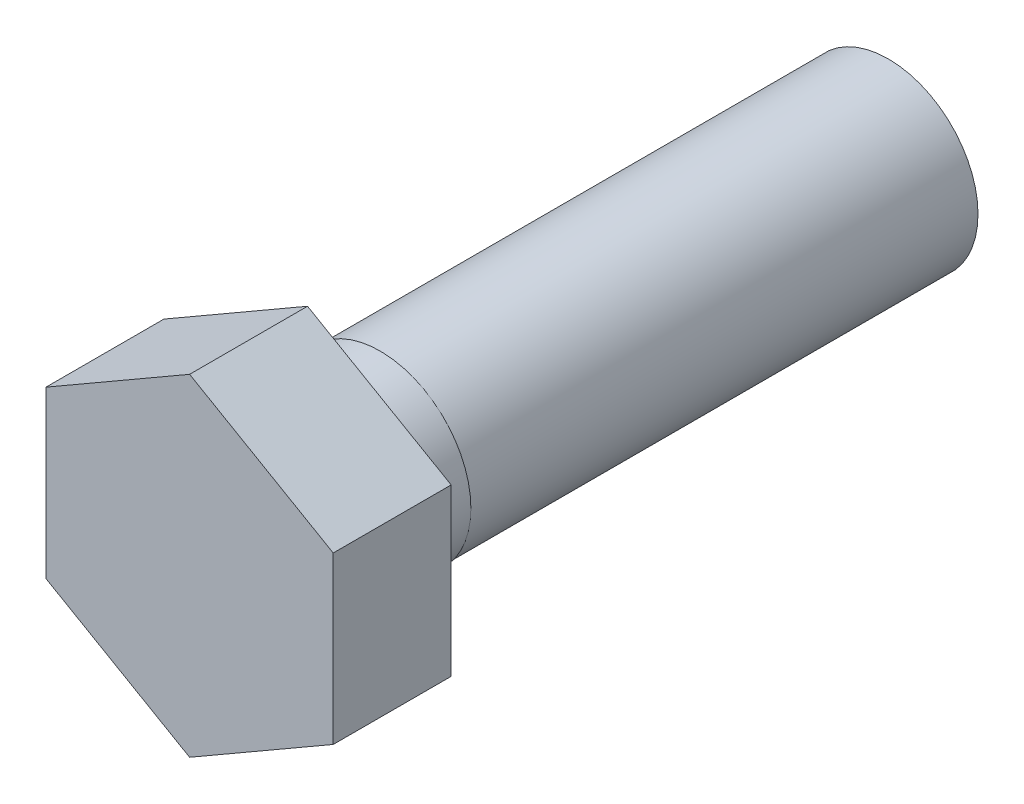
ISO-10303-21;
HEADER;
FILE_DESCRIPTION(('STEP AP214'),'2;1');
FILE_NAME('part.step','',(''),(''),'','','');
FILE_SCHEMA(('AUTOMOTIVE_DESIGN { 1 0 10303 214 1 1 1 1 }'));
ENDSEC;
DATA;
#1=APPLICATION_CONTEXT('core data for automotive mechanical design processes');
#2=APPLICATION_PROTOCOL_DEFINITION('international standard','automotive_design',2000,#1);
#3=PRODUCT_CONTEXT('',#1,'mechanical');
#4=PRODUCT('Part','Part','',(#3));
#5=PRODUCT_RELATED_PRODUCT_CATEGORY('part','',(#4));
#6=PRODUCT_DEFINITION_FORMATION('','',#4);
#7=PRODUCT_DEFINITION_CONTEXT('part definition',#1,'design');
#8=PRODUCT_DEFINITION('design','',#6,#7);
#9=PRODUCT_DEFINITION_SHAPE('','',#8);
#10=(LENGTH_UNIT() NAMED_UNIT(*) SI_UNIT(.MILLI.,.METRE.));
#11=(NAMED_UNIT(*) PLANE_ANGLE_UNIT() SI_UNIT($,.RADIAN.));
#12=(NAMED_UNIT(*) SI_UNIT($,.STERADIAN.) SOLID_ANGLE_UNIT());
#13=UNCERTAINTY_MEASURE_WITH_UNIT(LENGTH_MEASURE(1.E-05),#10,'distance_accuracy_value','');
#14=(GEOMETRIC_REPRESENTATION_CONTEXT(3) GLOBAL_UNCERTAINTY_ASSIGNED_CONTEXT((#13)) GLOBAL_UNIT_ASSIGNED_CONTEXT((#10,
#11,#12)) REPRESENTATION_CONTEXT('',''));
#15=CARTESIAN_POINT('',(0.,0.,0.));
#16=DIRECTION('',(0.,0.,1.));
#17=DIRECTION('',(1.,0.,0.));
#18=AXIS2_PLACEMENT_3D('',#15,#16,#17);
#19=CARTESIAN_POINT('',(4.44089209850063E-13,3.88578058618805E-13,-25.4));
#20=DIRECTION('',(0.,0.,0.999999999999999));
#21=DIRECTION('',(1.,0.,0.));
#22=AXIS2_PLACEMENT_3D('',#19,#20,#21);
#23=CYLINDRICAL_SURFACE('',#22,3.96875);
#24=CARTESIAN_POINT('',(0.,0.,0.));
#25=DIRECTION('',(0.,0.,-0.999999999999999));
#26=DIRECTION('',(-1.,0.,0.));
#27=AXIS2_PLACEMENT_3D('',#24,#25,#26);
#28=CIRCLE('',#27,3.96875);
#29=CARTESIAN_POINT('',(-3.96875,0.,0.));
#30=VERTEX_POINT('',#29);
#31=EDGE_CURVE('E11',#30,#30,#28,.T.);
#32=ORIENTED_EDGE('',*,*,#31,.T.);
#33=EDGE_LOOP('',(#32));
#34=FACE_BOUND('',#33,.T.);
#35=CARTESIAN_POINT('',(0.,-2.77555756156289E-13,-3.17500000000027));
#36=DIRECTION('',(0.,0.,0.999999999999999));
#37=DIRECTION('',(1.,0.,0.));
#38=AXIS2_PLACEMENT_3D('',#35,#36,#37);
#39=CIRCLE('',#38,3.96875);
#40=CARTESIAN_POINT('',(3.96875,-2.78436995682085E-13,-3.17500000000027));
#41=VERTEX_POINT('',#40);
#42=EDGE_CURVE('E105',#41,#41,#39,.T.);
#43=ORIENTED_EDGE('',*,*,#42,.T.);
#44=EDGE_LOOP('',(#43));
#45=FACE_BOUND('',#44,.T.);
#46=ADVANCED_FACE('F32',(#34,#45),#23,.T.);
#47=CARTESIAN_POINT('',(-6.28014999999937,3.62584629305135,5.15619999999993));
#48=DIRECTION('',(-0.500000000000003,0.866025403784437,0.));
#49=DIRECTION('',(-0.866025403784437,-0.500000000000003,0.));
#50=AXIS2_PLACEMENT_3D('',#47,#48,#49);
#51=PLANE('',#50);
#52=DIRECTION('',(0.866025403784437,0.500000000000003,0.));
#53=VECTOR('',#52,1.);
#54=CARTESIAN_POINT('',(-6.28014999999937,3.62584629305068,-2.91433543964104E-13));
#55=LINE('',#54,#53);
#56=CARTESIAN_POINT('',(-6.28014999999937,3.62584629305068,-2.91433543964104E-13));
#57=VERTEX_POINT('',#56);
#58=CARTESIAN_POINT('',(0.,7.25169258610231,0.));
#59=VERTEX_POINT('',#58);
#60=EDGE_CURVE('E86',#57,#59,#55,.T.);
#61=ORIENTED_EDGE('',*,*,#60,.F.);
#62=DIRECTION('',(0.,0.,-0.999999999999999));
#63=VECTOR('',#62,1.);
#64=CARTESIAN_POINT('',(-6.28014999999937,3.62584629305135,5.15619999999993));
#65=LINE('',#64,#63);
#66=CARTESIAN_POINT('',(-6.28014999999937,3.62584629305135,5.15619999999993));
#67=VERTEX_POINT('',#66);
#68=EDGE_CURVE('E40',#67,#57,#65,.T.);
#69=ORIENTED_EDGE('',*,*,#68,.F.);
#70=DIRECTION('',(0.866025403784437,0.500000000000003,0.));
#71=VECTOR('',#70,1.);
#72=CARTESIAN_POINT('',(-6.28014999999937,3.62584629305135,5.15619999999993));
#73=LINE('',#72,#71);
#74=CARTESIAN_POINT('',(0.,7.25169258610231,5.15620000000004));
#75=VERTEX_POINT('',#74);
#76=EDGE_CURVE('E88',#67,#75,#73,.T.);
#77=ORIENTED_EDGE('',*,*,#76,.T.);
#78=DIRECTION('',(0.,0.,-0.999999999999999));
#79=VECTOR('',#78,1.);
#80=CARTESIAN_POINT('',(0.,7.25169258610231,5.15620000000004));
#81=LINE('',#80,#79);
#82=EDGE_CURVE('E83',#75,#59,#81,.T.);
#83=ORIENTED_EDGE('',*,*,#82,.T.);
#84=EDGE_LOOP('',(#61,#69,#77,#83));
#85=FACE_BOUND('',#84,.T.);
#86=ADVANCED_FACE('F34',(#85),#51,.T.);
#87=CARTESIAN_POINT('',(-6.28014999999982,-3.62584629305146,5.1562000000001));
#88=DIRECTION('',(-1.,0.,0.));
#89=DIRECTION('',(0.,-1.,0.));
#90=AXIS2_PLACEMENT_3D('',#87,#88,#89);
#91=PLANE('',#90);
#92=DIRECTION('',(0.,1.,0.));
#93=VECTOR('',#92,1.);
#94=CARTESIAN_POINT('',(-6.28014999999893,-3.62584629305146,-1.52655665885959E-13));
#95=LINE('',#94,#93);
#96=CARTESIAN_POINT('',(-6.28014999999893,-3.62584629305146,-1.52655665885959E-13));
#97=VERTEX_POINT('',#96);
#98=EDGE_CURVE('E104',#97,#57,#95,.T.);
#99=ORIENTED_EDGE('',*,*,#98,.F.);
#100=DIRECTION('',(0.,0.,-0.999999999999999));
#101=VECTOR('',#100,1.);
#102=CARTESIAN_POINT('',(-6.28014999999982,-3.62584629305146,5.1562000000001));
#103=LINE('',#102,#101);
#104=CARTESIAN_POINT('',(-6.28014999999982,-3.62584629305146,5.1562000000001));
#105=VERTEX_POINT('',#104);
#106=EDGE_CURVE('E54',#105,#97,#103,.T.);
#107=ORIENTED_EDGE('',*,*,#106,.F.);
#108=DIRECTION('',(0.,1.,0.));
#109=VECTOR('',#108,1.);
#110=CARTESIAN_POINT('',(-6.28014999999982,-3.62584629305146,5.1562000000001));
#111=LINE('',#110,#109);
#112=EDGE_CURVE('E93',#105,#67,#111,.T.);
#113=ORIENTED_EDGE('',*,*,#112,.T.);
#114=ORIENTED_EDGE('',*,*,#68,.T.);
#115=EDGE_LOOP('',(#99,#107,#113,#114));
#116=FACE_BOUND('',#115,.T.);
#117=ADVANCED_FACE('F146',(#116),#91,.T.);
#118=CARTESIAN_POINT('',(8.88178419700125E-13,-7.25169258610286,5.15619999999987));
#119=DIRECTION('',(-0.499999999999997,-0.866025403784441,0.));
#120=DIRECTION('',(0.86602540378444,-0.499999999999998,0.));
#121=AXIS2_PLACEMENT_3D('',#118,#119,#120);
#122=PLANE('',#121);
#123=DIRECTION('',(-0.86602540378444,0.499999999999998,0.));
#124=VECTOR('',#123,1.);
#125=CARTESIAN_POINT('',(0.,-7.25169258610242,0.));
#126=LINE('',#125,#124);
#127=CARTESIAN_POINT('',(0.,-7.25169258610242,0.));
#128=VERTEX_POINT('',#127);
#129=EDGE_CURVE('E116',#128,#97,#126,.T.);
#130=ORIENTED_EDGE('',*,*,#129,.F.);
#131=DIRECTION('',(0.,0.,-0.999999999999999));
#132=VECTOR('',#131,1.);
#133=CARTESIAN_POINT('',(8.88178419700125E-13,-7.25169258610286,5.15619999999987));
#134=LINE('',#133,#132);
#135=CARTESIAN_POINT('',(8.88178419700125E-13,-7.25169258610286,5.15619999999987));
#136=VERTEX_POINT('',#135);
#137=EDGE_CURVE('E133',#136,#128,#134,.T.);
#138=ORIENTED_EDGE('',*,*,#137,.F.);
#139=DIRECTION('',(-0.86602540378444,0.499999999999998,0.));
#140=VECTOR('',#139,1.);
#141=CARTESIAN_POINT('',(8.88178419700125E-13,-7.25169258610286,5.15619999999987));
#142=LINE('',#141,#140);
#143=EDGE_CURVE('E128',#136,#105,#142,.T.);
#144=ORIENTED_EDGE('',*,*,#143,.T.);
#145=ORIENTED_EDGE('',*,*,#106,.T.);
#146=EDGE_LOOP('',(#130,#138,#144,#145));
#147=FACE_BOUND('',#146,.T.);
#148=ADVANCED_FACE('F151',(#147),#122,.T.);
#149=CARTESIAN_POINT('',(6.28015000000026,-3.62584629305102,5.15619999999982));
#150=DIRECTION('',(0.499999999999999,-0.866025403784439,0.));
#151=DIRECTION('',(0.866025403784438,0.5,0.));
#152=AXIS2_PLACEMENT_3D('',#149,#150,#151);
#153=PLANE('',#152);
#154=DIRECTION('',(-0.866025403784438,-0.5,0.));
#155=VECTOR('',#154,1.);
#156=CARTESIAN_POINT('',(6.28014999999982,-3.62584629305135,0.));
#157=LINE('',#156,#155);
#158=CARTESIAN_POINT('',(6.28014999999982,-3.62584629305135,0.));
#159=VERTEX_POINT('',#158);
#160=EDGE_CURVE('E113',#159,#128,#157,.T.);
#161=ORIENTED_EDGE('',*,*,#160,.F.);
#162=DIRECTION('',(0.,0.,-0.999999999999999));
#163=VECTOR('',#162,1.);
#164=CARTESIAN_POINT('',(6.28015000000026,-3.62584629305102,5.15619999999982));
#165=LINE('',#164,#163);
#166=CARTESIAN_POINT('',(6.28015000000026,-3.62584629305102,5.15619999999982));
#167=VERTEX_POINT('',#166);
#168=EDGE_CURVE('E135',#167,#159,#165,.T.);
#169=ORIENTED_EDGE('',*,*,#168,.F.);
#170=DIRECTION('',(-0.866025403784438,-0.5,0.));
#171=VECTOR('',#170,1.);
#172=CARTESIAN_POINT('',(6.28015000000026,-3.62584629305102,5.15619999999982));
#173=LINE('',#172,#171);
#174=EDGE_CURVE('E125',#167,#136,#173,.T.);
#175=ORIENTED_EDGE('',*,*,#174,.T.);
#176=ORIENTED_EDGE('',*,*,#137,.T.);
#177=EDGE_LOOP('',(#161,#169,#175,#176));
#178=FACE_BOUND('',#177,.T.);
#179=ADVANCED_FACE('F143',(#178),#153,.T.);
#180=CARTESIAN_POINT('',(6.28015000000026,3.62584629305091,5.15619999999979));
#181=DIRECTION('',(1.,0.,0.));
#182=DIRECTION('',(0.,1.,0.));
#183=AXIS2_PLACEMENT_3D('',#180,#181,#182);
#184=PLANE('',#183);
#185=DIRECTION('',(0.,-1.,0.));
#186=VECTOR('',#185,1.);
#187=CARTESIAN_POINT('',(6.28015000000026,3.62584629305135,-3.19189119579733E-13));
#188=LINE('',#187,#186);
#189=CARTESIAN_POINT('',(6.28015000000026,3.62584629305135,-3.19189119579733E-13));
#190=VERTEX_POINT('',#189);
#191=EDGE_CURVE('E100',#190,#159,#188,.T.);
#192=ORIENTED_EDGE('',*,*,#191,.F.);
#193=DIRECTION('',(0.,0.,-0.999999999999999));
#194=VECTOR('',#193,1.);
#195=CARTESIAN_POINT('',(6.28015000000026,3.62584629305091,5.15619999999979));
#196=LINE('',#195,#194);
#197=CARTESIAN_POINT('',(6.28015000000026,3.62584629305091,5.15619999999979));
#198=VERTEX_POINT('',#197);
#199=EDGE_CURVE('E92',#198,#190,#196,.T.);
#200=ORIENTED_EDGE('',*,*,#199,.F.);
#201=DIRECTION('',(0.,-1.,0.));
#202=VECTOR('',#201,1.);
#203=CARTESIAN_POINT('',(6.28015000000026,3.62584629305091,5.15619999999979));
#204=LINE('',#203,#202);
#205=EDGE_CURVE('E122',#198,#167,#204,.T.);
#206=ORIENTED_EDGE('',*,*,#205,.T.);
#207=ORIENTED_EDGE('',*,*,#168,.T.);
#208=EDGE_LOOP('',(#192,#200,#206,#207));
#209=FACE_BOUND('',#208,.T.);
#210=ADVANCED_FACE('F139',(#209),#184,.T.);
#211=CARTESIAN_POINT('',(0.,7.25169258610231,5.15620000000004));
#212=DIRECTION('',(0.500000000000004,0.866025403784436,0.));
#213=DIRECTION('',(-0.866025403784436,0.500000000000005,0.));
#214=AXIS2_PLACEMENT_3D('',#211,#212,#213);
#215=PLANE('',#214);
#216=DIRECTION('',(0.866025403784436,-0.500000000000005,0.));
#217=VECTOR('',#216,1.);
#218=CARTESIAN_POINT('',(0.,7.25169258610231,0.));
#219=LINE('',#218,#217);
#220=EDGE_CURVE('E95',#59,#190,#219,.T.);
#221=ORIENTED_EDGE('',*,*,#220,.F.);
#222=ORIENTED_EDGE('',*,*,#82,.F.);
#223=DIRECTION('',(0.866025403784436,-0.500000000000005,0.));
#224=VECTOR('',#223,1.);
#225=CARTESIAN_POINT('',(0.,7.25169258610231,5.15620000000004));
#226=LINE('',#225,#224);
#227=EDGE_CURVE('E120',#75,#198,#226,.T.);
#228=ORIENTED_EDGE('',*,*,#227,.T.);
#229=ORIENTED_EDGE('',*,*,#199,.T.);
#230=EDGE_LOOP('',(#221,#222,#228,#229));
#231=FACE_BOUND('',#230,.T.);
#232=ADVANCED_FACE('F96',(#231),#215,.T.);
#233=CARTESIAN_POINT('',(0.,7.25169258610231,5.15620000000004));
#234=DIRECTION('',(0.,0.,-0.999999999999999));
#235=DIRECTION('',(-1.,0.,0.));
#236=AXIS2_PLACEMENT_3D('',#233,#234,#235);
#237=PLANE('',#236);
#238=ORIENTED_EDGE('',*,*,#76,.F.);
#239=ORIENTED_EDGE('',*,*,#112,.F.);
#240=ORIENTED_EDGE('',*,*,#143,.F.);
#241=ORIENTED_EDGE('',*,*,#174,.F.);
#242=ORIENTED_EDGE('',*,*,#205,.F.);
#243=ORIENTED_EDGE('',*,*,#227,.F.);
#244=EDGE_LOOP('',(#238,#239,#240,#241,#242,#243));
#245=FACE_BOUND('',#244,.T.);
#246=ADVANCED_FACE('F150',(#245),#237,.F.);
#247=CARTESIAN_POINT('',(0.,7.25169258610231,0.));
#248=DIRECTION('',(0.,0.,-0.999999999999999));
#249=DIRECTION('',(-1.,0.,0.));
#250=AXIS2_PLACEMENT_3D('',#247,#248,#249);
#251=PLANE('',#250);
#252=ORIENTED_EDGE('',*,*,#31,.F.);
#253=EDGE_LOOP('',(#252));
#254=FACE_BOUND('',#253,.T.);
#255=ORIENTED_EDGE('',*,*,#60,.T.);
#256=ORIENTED_EDGE('',*,*,#220,.T.);
#257=ORIENTED_EDGE('',*,*,#191,.T.);
#258=ORIENTED_EDGE('',*,*,#160,.T.);
#259=ORIENTED_EDGE('',*,*,#129,.T.);
#260=ORIENTED_EDGE('',*,*,#98,.T.);
#261=EDGE_LOOP('',(#255,#256,#257,#258,#259,#260));
#262=FACE_BOUND('',#261,.T.);
#263=ADVANCED_FACE('F102',(#254,#262),#251,.T.);
#264=CARTESIAN_POINT('',(0.,3.9687499999998,-3.17500000000003));
#265=DIRECTION('',(0.,0.,-0.999999999999999));
#266=DIRECTION('',(-1.,0.,0.));
#267=AXIS2_PLACEMENT_3D('',#264,#265,#266);
#268=PLANE('',#267);
#269=CARTESIAN_POINT('',(0.,-2.77555756156289E-13,-3.17500000000027));
#270=DIRECTION('',(0.,0.,0.999999999999999));
#271=DIRECTION('',(1.,0.,0.));
#272=AXIS2_PLACEMENT_3D('',#269,#270,#271);
#273=CIRCLE('',#272,3.91875);
#274=CARTESIAN_POINT('',(3.91875,-2.78425893451839E-13,-3.17500000000027));
#275=VERTEX_POINT('',#274);
#276=EDGE_CURVE('E108',#275,#275,#273,.T.);
#277=ORIENTED_EDGE('',*,*,#276,.T.);
#278=EDGE_LOOP('',(#277));
#279=FACE_BOUND('',#278,.T.);
#280=ORIENTED_EDGE('',*,*,#42,.F.);
#281=EDGE_LOOP('',(#280));
#282=FACE_BOUND('',#281,.T.);
#283=ADVANCED_FACE('F173',(#279,#282),#268,.T.);
#284=CARTESIAN_POINT('',(0.,-2.77555756156289E-13,-21.5519356247287));
#285=DIRECTION('',(0.,0.,0.999999999999999));
#286=DIRECTION('',(1.,0.,0.));
#287=AXIS2_PLACEMENT_3D('',#284,#285,#286);
#288=CYLINDRICAL_SURFACE('',#287,3.91875);
#289=CARTESIAN_POINT('',(4.44089209850063E-13,3.88578058618805E-13,-25.4));
#290=DIRECTION('',(0.,0.,0.999999999999999));
#291=DIRECTION('',(1.,0.,0.));
#292=AXIS2_PLACEMENT_3D('',#289,#290,#291);
#293=CIRCLE('',#292,3.91875);
#294=CARTESIAN_POINT('',(3.91875000000044,3.87707921323255E-13,-25.4));
#295=VERTEX_POINT('',#294);
#296=EDGE_CURVE('E242',#295,#295,#293,.T.);
#297=ORIENTED_EDGE('',*,*,#296,.T.);
#298=EDGE_LOOP('',(#297));
#299=FACE_BOUND('',#298,.T.);
#300=ORIENTED_EDGE('',*,*,#276,.F.);
#301=EDGE_LOOP('',(#300));
#302=FACE_BOUND('',#301,.T.);
#303=ADVANCED_FACE('F224',(#299,#302),#288,.T.);
#304=CARTESIAN_POINT('',(4.44089209850063E-13,3.88578058618805E-13,-25.4));
#305=DIRECTION('',(0.,0.,0.999999999999999));
#306=DIRECTION('',(1.,0.,0.));
#307=AXIS2_PLACEMENT_3D('',#304,#305,#306);
#308=PLANE('',#307);
#309=ORIENTED_EDGE('',*,*,#296,.F.);
#310=EDGE_LOOP('',(#309));
#311=FACE_BOUND('',#310,.T.);
#312=ADVANCED_FACE('F169',(#311),#308,.F.);
#313=CLOSED_SHELL('',(#46,#86,#117,#148,#179,#210,#232,#246,#263,#283,#303,#312));
#314=MANIFOLD_SOLID_BREP('B2',#313);
#315=ADVANCED_BREP_SHAPE_REPRESENTATION('',(#18,#314),#14);
#316=SHAPE_DEFINITION_REPRESENTATION(#9,#315);
ENDSEC;
END-ISO-10303-21;
